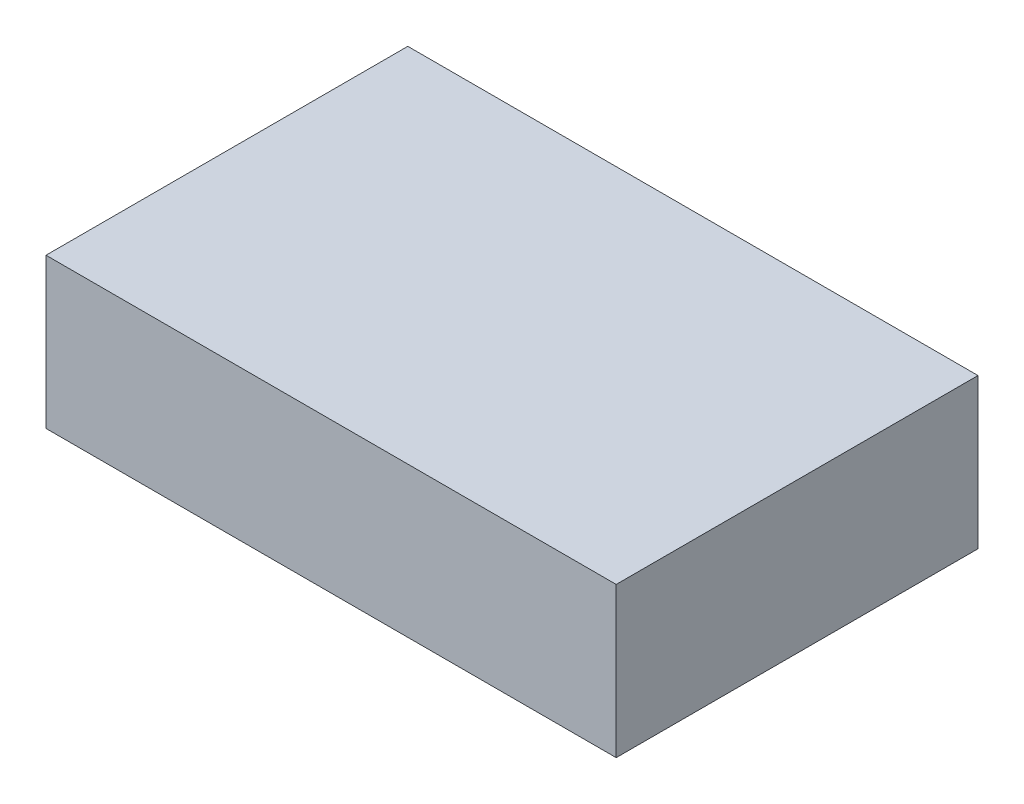
ISO-10303-21;
HEADER;
FILE_DESCRIPTION(('STEP AP214'),'2;1');
FILE_NAME('part.step','',(''),(''),'','','');
FILE_SCHEMA(('AUTOMOTIVE_DESIGN { 1 0 10303 214 1 1 1 1 }'));
ENDSEC;
DATA;
#1=APPLICATION_CONTEXT('core data for automotive mechanical design processes');
#2=APPLICATION_PROTOCOL_DEFINITION('international standard','automotive_design',2000,#1);
#3=PRODUCT_CONTEXT('',#1,'mechanical');
#4=PRODUCT('Part','Part','',(#3));
#5=PRODUCT_RELATED_PRODUCT_CATEGORY('part','',(#4));
#6=PRODUCT_DEFINITION_FORMATION('','',#4);
#7=PRODUCT_DEFINITION_CONTEXT('part definition',#1,'design');
#8=PRODUCT_DEFINITION('design','',#6,#7);
#9=PRODUCT_DEFINITION_SHAPE('','',#8);
#10=(LENGTH_UNIT() NAMED_UNIT(*) SI_UNIT(.MILLI.,.METRE.));
#11=(NAMED_UNIT(*) PLANE_ANGLE_UNIT() SI_UNIT($,.RADIAN.));
#12=(NAMED_UNIT(*) SI_UNIT($,.STERADIAN.) SOLID_ANGLE_UNIT());
#13=UNCERTAINTY_MEASURE_WITH_UNIT(LENGTH_MEASURE(1.E-05),#10,'distance_accuracy_value','');
#14=(GEOMETRIC_REPRESENTATION_CONTEXT(3) GLOBAL_UNCERTAINTY_ASSIGNED_CONTEXT((#13)) GLOBAL_UNIT_ASSIGNED_CONTEXT((#10,
#11,#12)) REPRESENTATION_CONTEXT('',''));
#15=CARTESIAN_POINT('',(0.,0.,0.));
#16=DIRECTION('',(0.,0.,1.));
#17=DIRECTION('',(1.,0.,0.));
#18=AXIS2_PLACEMENT_3D('',#15,#16,#17);
#19=CARTESIAN_POINT('',(-1.42500096,0.37500052,0.));
#20=DIRECTION('',(0.,1.,0.));
#21=DIRECTION('',(0.,0.,1.));
#22=AXIS2_PLACEMENT_3D('',#19,#20,#21);
#23=PLANE('',#22);
#24=DIRECTION('',(0.,0.,-1.));
#25=VECTOR('',#24,1.);
#26=CARTESIAN_POINT('',(1.42500096,0.37500052,0.));
#27=LINE('',#26,#25);
#28=CARTESIAN_POINT('',(1.42500096,0.37500052,0.));
#29=VERTEX_POINT('',#28);
#30=CARTESIAN_POINT('',(1.42500096,0.37500052,1.80848));
#31=VERTEX_POINT('',#30);
#32=EDGE_CURVE('E20',#29,#31,#27,.F.);
#33=ORIENTED_EDGE('',*,*,#32,.F.);
#34=DIRECTION('',(1.,0.,0.));
#35=VECTOR('',#34,1.);
#36=CARTESIAN_POINT('',(1.42500096,0.37500052,0.));
#37=LINE('',#36,#35);
#38=CARTESIAN_POINT('',(-1.42500096,0.37500052,0.));
#39=VERTEX_POINT('',#38);
#40=EDGE_CURVE('E80',#29,#39,#37,.F.);
#41=ORIENTED_EDGE('',*,*,#40,.T.);
#42=DIRECTION('',(0.,0.,1.));
#43=VECTOR('',#42,1.);
#44=CARTESIAN_POINT('',(-1.42500096,0.37500052,0.));
#45=LINE('',#44,#43);
#46=CARTESIAN_POINT('',(-1.42500096,0.37500052,1.80848));
#47=VERTEX_POINT('',#46);
#48=EDGE_CURVE('E68',#47,#39,#45,.F.);
#49=ORIENTED_EDGE('',*,*,#48,.F.);
#50=DIRECTION('',(1.,0.,0.));
#51=VECTOR('',#50,1.);
#52=CARTESIAN_POINT('',(1.42500096,0.37500052,1.80848));
#53=LINE('',#52,#51);
#54=EDGE_CURVE('E56',#31,#47,#53,.F.);
#55=ORIENTED_EDGE('',*,*,#54,.F.);
#56=EDGE_LOOP('',(#33,#41,#49,#55));
#57=FACE_BOUND('',#56,.T.);
#58=ADVANCED_FACE('F17',(#57),#23,.T.);
#59=CARTESIAN_POINT('',(1.42500096,0.37500052,0.));
#60=DIRECTION('',(1.,0.,0.));
#61=DIRECTION('',(0.,0.,-1.));
#62=AXIS2_PLACEMENT_3D('',#59,#60,#61);
#63=PLANE('',#62);
#64=DIRECTION('',(0.,0.,-1.));
#65=VECTOR('',#64,1.);
#66=CARTESIAN_POINT('',(1.42500096,-0.37500052,0.));
#67=LINE('',#66,#65);
#68=CARTESIAN_POINT('',(1.42500096,-0.37500052,0.));
#69=VERTEX_POINT('',#68);
#70=CARTESIAN_POINT('',(1.42500096,-0.37500052,1.80848));
#71=VERTEX_POINT('',#70);
#72=EDGE_CURVE('E83',#69,#71,#67,.F.);
#73=ORIENTED_EDGE('',*,*,#72,.F.);
#74=DIRECTION('',(0.,1.,0.));
#75=VECTOR('',#74,1.);
#76=CARTESIAN_POINT('',(1.42500096,-0.37500052,0.));
#77=LINE('',#76,#75);
#78=EDGE_CURVE('E65',#69,#29,#77,.T.);
#79=ORIENTED_EDGE('',*,*,#78,.T.);
#80=ORIENTED_EDGE('',*,*,#32,.T.);
#81=DIRECTION('',(0.,1.,0.));
#82=VECTOR('',#81,1.);
#83=CARTESIAN_POINT('',(1.42500096,-0.37500052,1.80848));
#84=LINE('',#83,#82);
#85=EDGE_CURVE('E62',#71,#31,#84,.T.);
#86=ORIENTED_EDGE('',*,*,#85,.F.);
#87=EDGE_LOOP('',(#73,#79,#80,#86));
#88=FACE_BOUND('',#87,.T.);
#89=ADVANCED_FACE('F61',(#88),#63,.T.);
#90=CARTESIAN_POINT('',(1.42500096,-0.37500052,1.80848));
#91=DIRECTION('',(0.,0.,1.));
#92=DIRECTION('',(1.,0.,0.));
#93=AXIS2_PLACEMENT_3D('',#90,#91,#92);
#94=PLANE('',#93);
#95=DIRECTION('',(0.,1.,0.));
#96=VECTOR('',#95,1.);
#97=CARTESIAN_POINT('',(-1.42500096,-0.37500052,1.80848));
#98=LINE('',#97,#96);
#99=CARTESIAN_POINT('',(-1.42500096,-0.37500052,1.80848));
#100=VERTEX_POINT('',#99);
#101=EDGE_CURVE('E70',#100,#47,#98,.T.);
#102=ORIENTED_EDGE('',*,*,#101,.F.);
#103=DIRECTION('',(1.,0.,0.));
#104=VECTOR('',#103,1.);
#105=CARTESIAN_POINT('',(1.42500096,-0.37500052,1.80848));
#106=LINE('',#105,#104);
#107=EDGE_CURVE('E74',#71,#100,#106,.F.);
#108=ORIENTED_EDGE('',*,*,#107,.F.);
#109=ORIENTED_EDGE('',*,*,#85,.T.);
#110=ORIENTED_EDGE('',*,*,#54,.T.);
#111=EDGE_LOOP('',(#102,#108,#109,#110));
#112=FACE_BOUND('',#111,.T.);
#113=ADVANCED_FACE('F72',(#112),#94,.T.);
#114=CARTESIAN_POINT('',(-1.42500096,-0.37500052,0.));
#115=DIRECTION('',(-1.,0.,0.));
#116=DIRECTION('',(0.,0.,1.));
#117=AXIS2_PLACEMENT_3D('',#114,#115,#116);
#118=PLANE('',#117);
#119=ORIENTED_EDGE('',*,*,#48,.T.);
#120=DIRECTION('',(0.,1.,0.));
#121=VECTOR('',#120,1.);
#122=CARTESIAN_POINT('',(-1.42500096,-0.37500052,0.));
#123=LINE('',#122,#121);
#124=CARTESIAN_POINT('',(-1.42500096,-0.37500052,0.));
#125=VERTEX_POINT('',#124);
#126=EDGE_CURVE('E35',#39,#125,#123,.F.);
#127=ORIENTED_EDGE('',*,*,#126,.T.);
#128=DIRECTION('',(0.,0.,-1.));
#129=VECTOR('',#128,1.);
#130=CARTESIAN_POINT('',(-1.42500096,-0.37500052,0.));
#131=LINE('',#130,#129);
#132=EDGE_CURVE('E26',#100,#125,#131,.T.);
#133=ORIENTED_EDGE('',*,*,#132,.F.);
#134=ORIENTED_EDGE('',*,*,#101,.T.);
#135=EDGE_LOOP('',(#119,#127,#133,#134));
#136=FACE_BOUND('',#135,.T.);
#137=ADVANCED_FACE('F89',(#136),#118,.T.);
#138=CARTESIAN_POINT('',(1.42500096,-0.37500052,0.));
#139=DIRECTION('',(0.,0.,1.));
#140=DIRECTION('',(1.,0.,0.));
#141=AXIS2_PLACEMENT_3D('',#138,#139,#140);
#142=PLANE('',#141);
#143=ORIENTED_EDGE('',*,*,#126,.F.);
#144=ORIENTED_EDGE('',*,*,#40,.F.);
#145=ORIENTED_EDGE('',*,*,#78,.F.);
#146=DIRECTION('',(1.,0.,0.));
#147=VECTOR('',#146,1.);
#148=CARTESIAN_POINT('',(1.42500096,-0.37500052,0.));
#149=LINE('',#148,#147);
#150=EDGE_CURVE('E11',#125,#69,#149,.T.);
#151=ORIENTED_EDGE('',*,*,#150,.F.);
#152=EDGE_LOOP('',(#143,#144,#145,#151));
#153=FACE_BOUND('',#152,.T.);
#154=ADVANCED_FACE('F91',(#153),#142,.F.);
#155=CARTESIAN_POINT('',(1.42500096,-0.37500052,0.));
#156=DIRECTION('',(0.,-1.,0.));
#157=DIRECTION('',(0.,0.,-1.));
#158=AXIS2_PLACEMENT_3D('',#155,#156,#157);
#159=PLANE('',#158);
#160=ORIENTED_EDGE('',*,*,#132,.T.);
#161=ORIENTED_EDGE('',*,*,#150,.T.);
#162=ORIENTED_EDGE('',*,*,#72,.T.);
#163=ORIENTED_EDGE('',*,*,#107,.T.);
#164=EDGE_LOOP('',(#160,#161,#162,#163));
#165=FACE_BOUND('',#164,.T.);
#166=ADVANCED_FACE('F88',(#165),#159,.T.);
#167=CLOSED_SHELL('',(#58,#89,#113,#137,#154,#166));
#168=MANIFOLD_SOLID_BREP('B1',#167);
#169=ADVANCED_BREP_SHAPE_REPRESENTATION('',(#18,#168),#14);
#170=SHAPE_DEFINITION_REPRESENTATION(#9,#169);
ENDSEC;
END-ISO-10303-21;
